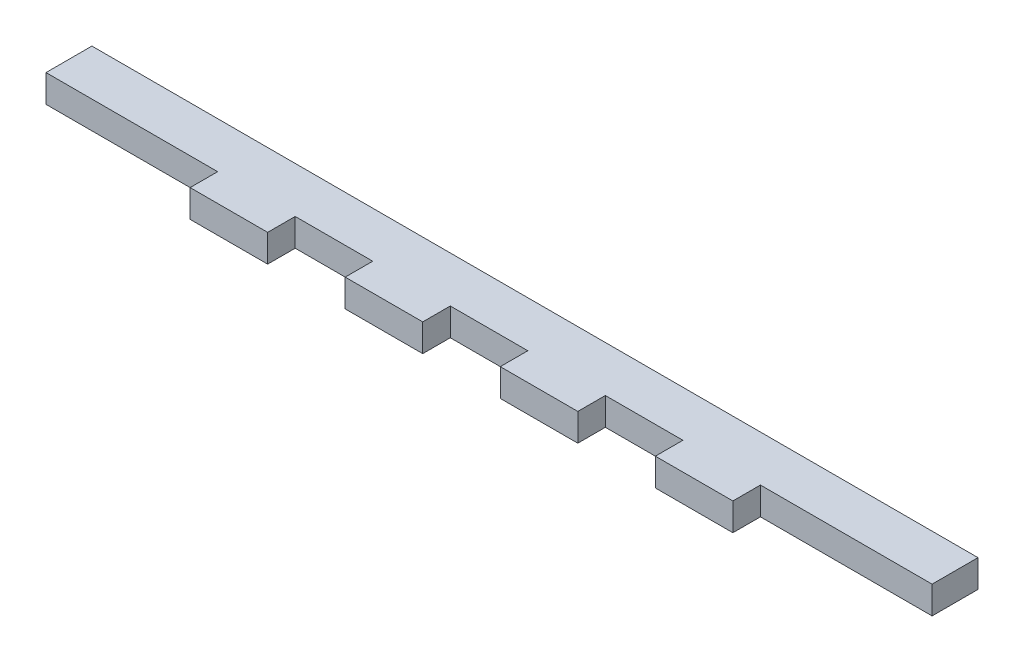
ISO-10303-21;
HEADER;
FILE_DESCRIPTION(('STEP AP214'),'2;1');
FILE_NAME('part.step','',(''),(''),'','','');
FILE_SCHEMA(('AUTOMOTIVE_DESIGN { 1 0 10303 214 1 1 1 1 }'));
ENDSEC;
DATA;
#1=APPLICATION_CONTEXT('core data for automotive mechanical design processes');
#2=APPLICATION_PROTOCOL_DEFINITION('international standard','automotive_design',2000,#1);
#3=PRODUCT_CONTEXT('',#1,'mechanical');
#4=PRODUCT('Part','Part','',(#3));
#5=PRODUCT_RELATED_PRODUCT_CATEGORY('part','',(#4));
#6=PRODUCT_DEFINITION_FORMATION('','',#4);
#7=PRODUCT_DEFINITION_CONTEXT('part definition',#1,'design');
#8=PRODUCT_DEFINITION('design','',#6,#7);
#9=PRODUCT_DEFINITION_SHAPE('','',#8);
#10=(LENGTH_UNIT() NAMED_UNIT(*) SI_UNIT(.MILLI.,.METRE.));
#11=(NAMED_UNIT(*) PLANE_ANGLE_UNIT() SI_UNIT($,.RADIAN.));
#12=(NAMED_UNIT(*) SI_UNIT($,.STERADIAN.) SOLID_ANGLE_UNIT());
#13=UNCERTAINTY_MEASURE_WITH_UNIT(LENGTH_MEASURE(1.E-05),#10,'distance_accuracy_value','');
#14=(GEOMETRIC_REPRESENTATION_CONTEXT(3) GLOBAL_UNCERTAINTY_ASSIGNED_CONTEXT((#13)) GLOBAL_UNIT_ASSIGNED_CONTEXT((#10,
#11,#12)) REPRESENTATION_CONTEXT('',''));
#15=CARTESIAN_POINT('',(0.,0.,0.));
#16=DIRECTION('',(0.,0.,1.));
#17=DIRECTION('',(1.,0.,0.));
#18=AXIS2_PLACEMENT_3D('',#15,#16,#17);
#19=CARTESIAN_POINT('',(-96.5,6.00000000000001,5.));
#20=DIRECTION('',(0.,0.,-1.));
#21=DIRECTION('',(-1.,0.,0.));
#22=AXIS2_PLACEMENT_3D('',#19,#20,#21);
#23=PLANE('',#22);
#24=DIRECTION('',(0.,-1.,0.));
#25=VECTOR('',#24,1.);
#26=CARTESIAN_POINT('',(42.2222222222222,23.9230178234926,5.));
#27=LINE('',#26,#25);
#28=CARTESIAN_POINT('',(42.2222222222222,6.00000000000001,5.));
#29=VERTEX_POINT('',#28);
#30=CARTESIAN_POINT('',(42.2222222222222,0.,5.));
#31=VERTEX_POINT('',#30);
#32=EDGE_CURVE('E64',#29,#31,#27,.T.);
#33=ORIENTED_EDGE('',*,*,#32,.F.);
#34=DIRECTION('',(1.,0.,0.));
#35=VECTOR('',#34,1.);
#36=CARTESIAN_POINT('',(-96.5,6.00000000000001,5.));
#37=LINE('',#36,#35);
#38=CARTESIAN_POINT('',(25.3333333333333,6.00000000000001,5.));
#39=VERTEX_POINT('',#38);
#40=EDGE_CURVE('E355',#39,#29,#37,.T.);
#41=ORIENTED_EDGE('',*,*,#40,.F.);
#42=DIRECTION('',(0.,-1.,0.));
#43=VECTOR('',#42,1.);
#44=CARTESIAN_POINT('',(25.3333333333333,23.9230178234926,5.));
#45=LINE('',#44,#43);
#46=CARTESIAN_POINT('',(25.3333333333333,0.,5.));
#47=VERTEX_POINT('',#46);
#48=EDGE_CURVE('E231',#39,#47,#45,.T.);
#49=ORIENTED_EDGE('',*,*,#48,.T.);
#50=DIRECTION('',(1.,0.,0.));
#51=VECTOR('',#50,1.);
#52=CARTESIAN_POINT('',(-96.5,0.,5.));
#53=LINE('',#52,#51);
#54=EDGE_CURVE('E361',#47,#31,#53,.T.);
#55=ORIENTED_EDGE('',*,*,#54,.T.);
#56=EDGE_LOOP('',(#33,#41,#49,#55));
#57=FACE_BOUND('',#56,.T.);
#58=ADVANCED_FACE('F39',(#57),#23,.F.);
#59=DIRECTION('',(0.,-1.,0.));
#60=VECTOR('',#59,1.);
#61=CARTESIAN_POINT('',(59.1111111111111,23.9230178234926,5.));
#62=LINE('',#61,#60);
#63=CARTESIAN_POINT('',(59.1111111111111,6.00000000000001,5.));
#64=VERTEX_POINT('',#63);
#65=CARTESIAN_POINT('',(59.1111111111111,0.,5.));
#66=VERTEX_POINT('',#65);
#67=EDGE_CURVE('E207',#64,#66,#62,.T.);
#68=ORIENTED_EDGE('',*,*,#67,.T.);
#69=CARTESIAN_POINT('',(96.5,0.,5.));
#70=VERTEX_POINT('',#69);
#71=EDGE_CURVE('E309',#66,#70,#53,.T.);
#72=ORIENTED_EDGE('',*,*,#71,.T.);
#73=DIRECTION('',(0.,-1.,0.));
#74=VECTOR('',#73,1.);
#75=CARTESIAN_POINT('',(96.5,6.00000000000001,5.));
#76=LINE('',#75,#74);
#77=CARTESIAN_POINT('',(96.5,6.00000000000001,5.));
#78=VERTEX_POINT('',#77);
#79=EDGE_CURVE('E316',#78,#70,#76,.T.);
#80=ORIENTED_EDGE('',*,*,#79,.F.);
#81=EDGE_CURVE('E56',#64,#78,#37,.T.);
#82=ORIENTED_EDGE('',*,*,#81,.F.);
#83=EDGE_LOOP('',(#68,#72,#80,#82));
#84=FACE_BOUND('',#83,.T.);
#85=ADVANCED_FACE('F360',(#84),#23,.F.);
#86=CARTESIAN_POINT('',(-42.2222222222222,6.00000000000001,5.));
#87=VERTEX_POINT('',#86);
#88=CARTESIAN_POINT('',(-25.3333333333333,6.00000000000001,5.));
#89=VERTEX_POINT('',#88);
#90=EDGE_CURVE('E302',#87,#89,#37,.T.);
#91=ORIENTED_EDGE('',*,*,#90,.F.);
#92=DIRECTION('',(0.,-1.,0.));
#93=VECTOR('',#92,1.);
#94=CARTESIAN_POINT('',(-42.2222222222222,23.9230178234926,5.));
#95=LINE('',#94,#93);
#96=CARTESIAN_POINT('',(-42.2222222222222,0.,5.));
#97=VERTEX_POINT('',#96);
#98=EDGE_CURVE('E257',#87,#97,#95,.T.);
#99=ORIENTED_EDGE('',*,*,#98,.T.);
#100=CARTESIAN_POINT('',(-25.3333333333333,0.,5.));
#101=VERTEX_POINT('',#100);
#102=EDGE_CURVE('E312',#97,#101,#53,.T.);
#103=ORIENTED_EDGE('',*,*,#102,.T.);
#104=DIRECTION('',(0.,-1.,0.));
#105=VECTOR('',#104,1.);
#106=CARTESIAN_POINT('',(-25.3333333333333,23.9230178234926,5.));
#107=LINE('',#106,#105);
#108=EDGE_CURVE('E285',#89,#101,#107,.T.);
#109=ORIENTED_EDGE('',*,*,#108,.F.);
#110=EDGE_LOOP('',(#91,#99,#103,#109));
#111=FACE_BOUND('',#110,.T.);
#112=ADVANCED_FACE('F352',(#111),#23,.F.);
#113=CARTESIAN_POINT('',(-96.5,0.,5.));
#114=VERTEX_POINT('',#113);
#115=CARTESIAN_POINT('',(-59.1111111111111,0.,5.));
#116=VERTEX_POINT('',#115);
#117=EDGE_CURVE('E310',#114,#116,#53,.T.);
#118=ORIENTED_EDGE('',*,*,#117,.T.);
#119=DIRECTION('',(0.,-1.,0.));
#120=VECTOR('',#119,1.);
#121=CARTESIAN_POINT('',(-59.1111111111111,23.9230178234926,5.));
#122=LINE('',#121,#120);
#123=CARTESIAN_POINT('',(-59.1111111111111,6.00000000000001,5.));
#124=VERTEX_POINT('',#123);
#125=EDGE_CURVE('E260',#124,#116,#122,.T.);
#126=ORIENTED_EDGE('',*,*,#125,.F.);
#127=CARTESIAN_POINT('',(-96.5,6.00000000000001,5.));
#128=VERTEX_POINT('',#127);
#129=EDGE_CURVE('E298',#128,#124,#37,.T.);
#130=ORIENTED_EDGE('',*,*,#129,.F.);
#131=DIRECTION('',(0.,-1.,0.));
#132=VECTOR('',#131,1.);
#133=CARTESIAN_POINT('',(-96.5,6.00000000000001,5.));
#134=LINE('',#133,#132);
#135=EDGE_CURVE('E48',#128,#114,#134,.T.);
#136=ORIENTED_EDGE('',*,*,#135,.T.);
#137=EDGE_LOOP('',(#118,#126,#130,#136));
#138=FACE_BOUND('',#137,.T.);
#139=ADVANCED_FACE('F333',(#138),#23,.F.);
#140=CARTESIAN_POINT('',(-96.5,6.00000000000001,-5.));
#141=DIRECTION('',(0.,0.,-1.));
#142=DIRECTION('',(-1.,0.,0.));
#143=AXIS2_PLACEMENT_3D('',#140,#141,#142);
#144=PLANE('',#143);
#145=DIRECTION('',(1.,0.,0.));
#146=VECTOR('',#145,1.);
#147=CARTESIAN_POINT('',(-96.5,0.,-5.));
#148=LINE('',#147,#146);
#149=CARTESIAN_POINT('',(-96.5,0.,-5.));
#150=VERTEX_POINT('',#149);
#151=CARTESIAN_POINT('',(96.5,0.,-5.));
#152=VERTEX_POINT('',#151);
#153=EDGE_CURVE('E290',#150,#152,#148,.T.);
#154=ORIENTED_EDGE('',*,*,#153,.F.);
#155=DIRECTION('',(0.,-1.,0.));
#156=VECTOR('',#155,1.);
#157=CARTESIAN_POINT('',(-96.5,6.00000000000001,-5.));
#158=LINE('',#157,#156);
#159=CARTESIAN_POINT('',(-96.5,6.00000000000001,-5.));
#160=VERTEX_POINT('',#159);
#161=EDGE_CURVE('E11',#160,#150,#158,.T.);
#162=ORIENTED_EDGE('',*,*,#161,.F.);
#163=DIRECTION('',(1.,0.,0.));
#164=VECTOR('',#163,1.);
#165=CARTESIAN_POINT('',(-96.5,6.00000000000001,-5.));
#166=LINE('',#165,#164);
#167=CARTESIAN_POINT('',(96.5,6.00000000000001,-5.));
#168=VERTEX_POINT('',#167);
#169=EDGE_CURVE('E291',#160,#168,#166,.T.);
#170=ORIENTED_EDGE('',*,*,#169,.T.);
#171=DIRECTION('',(0.,-1.,0.));
#172=VECTOR('',#171,1.);
#173=CARTESIAN_POINT('',(96.5,6.00000000000001,-5.));
#174=LINE('',#173,#172);
#175=EDGE_CURVE('E43',#168,#152,#174,.T.);
#176=ORIENTED_EDGE('',*,*,#175,.T.);
#177=EDGE_LOOP('',(#154,#162,#170,#176));
#178=FACE_BOUND('',#177,.T.);
#179=ADVANCED_FACE('F41',(#178),#144,.T.);
#180=CARTESIAN_POINT('',(-96.5,6.00000000000001,-5.));
#181=DIRECTION('',(1.,0.,0.));
#182=DIRECTION('',(0.,0.,-1.));
#183=AXIS2_PLACEMENT_3D('',#180,#181,#182);
#184=PLANE('',#183);
#185=DIRECTION('',(0.,0.,1.));
#186=VECTOR('',#185,1.);
#187=CARTESIAN_POINT('',(-96.5,0.,-5.));
#188=LINE('',#187,#186);
#189=EDGE_CURVE('E295',#150,#114,#188,.T.);
#190=ORIENTED_EDGE('',*,*,#189,.T.);
#191=ORIENTED_EDGE('',*,*,#135,.F.);
#192=DIRECTION('',(0.,0.,1.));
#193=VECTOR('',#192,1.);
#194=CARTESIAN_POINT('',(-96.5,6.00000000000001,-5.));
#195=LINE('',#194,#193);
#196=EDGE_CURVE('E301',#160,#128,#195,.T.);
#197=ORIENTED_EDGE('',*,*,#196,.F.);
#198=ORIENTED_EDGE('',*,*,#161,.T.);
#199=EDGE_LOOP('',(#190,#191,#197,#198));
#200=FACE_BOUND('',#199,.T.);
#201=ADVANCED_FACE('F329',(#200),#184,.F.);
#202=CARTESIAN_POINT('',(-8.44444444444445,0.,5.));
#203=VERTEX_POINT('',#202);
#204=CARTESIAN_POINT('',(8.44444444444445,0.,5.));
#205=VERTEX_POINT('',#204);
#206=EDGE_CURVE('E313',#203,#205,#53,.T.);
#207=ORIENTED_EDGE('',*,*,#206,.T.);
#208=DIRECTION('',(0.,-1.,0.));
#209=VECTOR('',#208,1.);
#210=CARTESIAN_POINT('',(8.44444444444445,23.9230178234926,5.));
#211=LINE('',#210,#209);
#212=CARTESIAN_POINT('',(8.44444444444445,6.00000000000001,5.));
#213=VERTEX_POINT('',#212);
#214=EDGE_CURVE('E234',#213,#205,#211,.T.);
#215=ORIENTED_EDGE('',*,*,#214,.F.);
#216=CARTESIAN_POINT('',(-8.44444444444445,6.00000000000001,5.));
#217=VERTEX_POINT('',#216);
#218=EDGE_CURVE('E303',#217,#213,#37,.T.);
#219=ORIENTED_EDGE('',*,*,#218,.F.);
#220=DIRECTION('',(0.,-1.,0.));
#221=VECTOR('',#220,1.);
#222=CARTESIAN_POINT('',(-8.44444444444445,23.9230178234926,5.));
#223=LINE('',#222,#221);
#224=EDGE_CURVE('E282',#217,#203,#223,.T.);
#225=ORIENTED_EDGE('',*,*,#224,.T.);
#226=EDGE_LOOP('',(#207,#215,#219,#225));
#227=FACE_BOUND('',#226,.T.);
#228=ADVANCED_FACE('F364',(#227),#23,.F.);
#229=CARTESIAN_POINT('',(96.5,6.00000000000001,-5.));
#230=DIRECTION('',(1.,0.,0.));
#231=DIRECTION('',(0.,0.,-1.));
#232=AXIS2_PLACEMENT_3D('',#229,#230,#231);
#233=PLANE('',#232);
#234=DIRECTION('',(0.,0.,1.));
#235=VECTOR('',#234,1.);
#236=CARTESIAN_POINT('',(96.5,0.,-5.));
#237=LINE('',#236,#235);
#238=EDGE_CURVE('E306',#152,#70,#237,.T.);
#239=ORIENTED_EDGE('',*,*,#238,.F.);
#240=ORIENTED_EDGE('',*,*,#175,.F.);
#241=DIRECTION('',(0.,0.,1.));
#242=VECTOR('',#241,1.);
#243=CARTESIAN_POINT('',(96.5,6.00000000000001,-5.));
#244=LINE('',#243,#242);
#245=EDGE_CURVE('E294',#168,#78,#244,.T.);
#246=ORIENTED_EDGE('',*,*,#245,.T.);
#247=ORIENTED_EDGE('',*,*,#79,.T.);
#248=EDGE_LOOP('',(#239,#240,#246,#247));
#249=FACE_BOUND('',#248,.T.);
#250=ADVANCED_FACE('F324',(#249),#233,.T.);
#251=CARTESIAN_POINT('',(0.,6.00000000000001,0.));
#252=DIRECTION('',(0.,-1.,0.));
#253=DIRECTION('',(0.,0.,-1.));
#254=AXIS2_PLACEMENT_3D('',#251,#252,#253);
#255=PLANE('',#254);
#256=ORIENTED_EDGE('',*,*,#169,.F.);
#257=ORIENTED_EDGE('',*,*,#196,.T.);
#258=ORIENTED_EDGE('',*,*,#129,.T.);
#259=DIRECTION('',(0.,0.,1.));
#260=VECTOR('',#259,1.);
#261=CARTESIAN_POINT('',(-59.1111111111111,6.00000000000001,0.));
#262=LINE('',#261,#260);
#263=CARTESIAN_POINT('',(-59.1111111111111,6.00000000000001,11.));
#264=VERTEX_POINT('',#263);
#265=EDGE_CURVE('E246',#124,#264,#262,.T.);
#266=ORIENTED_EDGE('',*,*,#265,.T.);
#267=DIRECTION('',(1.,0.,0.));
#268=VECTOR('',#267,1.);
#269=CARTESIAN_POINT('',(0.,6.00000000000001,11.));
#270=LINE('',#269,#268);
#271=CARTESIAN_POINT('',(-42.2222222222222,6.00000000000001,11.));
#272=VERTEX_POINT('',#271);
#273=EDGE_CURVE('E243',#264,#272,#270,.T.);
#274=ORIENTED_EDGE('',*,*,#273,.T.);
#275=DIRECTION('',(0.,0.,-1.));
#276=VECTOR('',#275,1.);
#277=CARTESIAN_POINT('',(-42.2222222222222,6.00000000000001,0.));
#278=LINE('',#277,#276);
#279=EDGE_CURVE('E240',#272,#87,#278,.T.);
#280=ORIENTED_EDGE('',*,*,#279,.T.);
#281=ORIENTED_EDGE('',*,*,#90,.T.);
#282=DIRECTION('',(0.,0.,1.));
#283=VECTOR('',#282,1.);
#284=CARTESIAN_POINT('',(-25.3333333333333,6.00000000000001,0.));
#285=LINE('',#284,#283);
#286=CARTESIAN_POINT('',(-25.3333333333333,6.00000000000001,11.));
#287=VERTEX_POINT('',#286);
#288=EDGE_CURVE('E272',#89,#287,#285,.T.);
#289=ORIENTED_EDGE('',*,*,#288,.T.);
#290=DIRECTION('',(1.,0.,0.));
#291=VECTOR('',#290,1.);
#292=CARTESIAN_POINT('',(0.,6.00000000000001,11.));
#293=LINE('',#292,#291);
#294=CARTESIAN_POINT('',(-8.44444444444445,6.00000000000001,11.));
#295=VERTEX_POINT('',#294);
#296=EDGE_CURVE('E269',#287,#295,#293,.T.);
#297=ORIENTED_EDGE('',*,*,#296,.T.);
#298=DIRECTION('',(0.,0.,1.));
#299=VECTOR('',#298,1.);
#300=CARTESIAN_POINT('',(-8.44444444444445,6.00000000000001,0.));
#301=LINE('',#300,#299);
#302=EDGE_CURVE('E266',#217,#295,#301,.T.);
#303=ORIENTED_EDGE('',*,*,#302,.F.);
#304=ORIENTED_EDGE('',*,*,#218,.T.);
#305=DIRECTION('',(0.,0.,1.));
#306=VECTOR('',#305,1.);
#307=CARTESIAN_POINT('',(8.44444444444445,6.00000000000001,0.));
#308=LINE('',#307,#306);
#309=CARTESIAN_POINT('',(8.44444444444445,6.00000000000001,11.));
#310=VERTEX_POINT('',#309);
#311=EDGE_CURVE('E219',#213,#310,#308,.T.);
#312=ORIENTED_EDGE('',*,*,#311,.T.);
#313=DIRECTION('',(-1.,0.,0.));
#314=VECTOR('',#313,1.);
#315=CARTESIAN_POINT('',(0.,6.00000000000001,11.));
#316=LINE('',#315,#314);
#317=CARTESIAN_POINT('',(25.3333333333333,6.00000000000001,11.));
#318=VERTEX_POINT('',#317);
#319=EDGE_CURVE('E215',#318,#310,#316,.T.);
#320=ORIENTED_EDGE('',*,*,#319,.F.);
#321=DIRECTION('',(0.,0.,1.));
#322=VECTOR('',#321,1.);
#323=CARTESIAN_POINT('',(25.3333333333333,6.00000000000001,0.));
#324=LINE('',#323,#322);
#325=EDGE_CURVE('E212',#39,#318,#324,.T.);
#326=ORIENTED_EDGE('',*,*,#325,.F.);
#327=ORIENTED_EDGE('',*,*,#40,.T.);
#328=DIRECTION('',(0.,0.,-1.));
#329=VECTOR('',#328,1.);
#330=CARTESIAN_POINT('',(42.2222222222222,6.00000000000001,0.));
#331=LINE('',#330,#329);
#332=CARTESIAN_POINT('',(42.2222222222222,6.00000000000001,11.));
#333=VERTEX_POINT('',#332);
#334=EDGE_CURVE('E206',#333,#29,#331,.T.);
#335=ORIENTED_EDGE('',*,*,#334,.F.);
#336=DIRECTION('',(-1.,0.,0.));
#337=VECTOR('',#336,1.);
#338=CARTESIAN_POINT('',(0.,6.00000000000001,11.));
#339=LINE('',#338,#337);
#340=CARTESIAN_POINT('',(59.1111111111111,6.00000000000001,11.));
#341=VERTEX_POINT('',#340);
#342=EDGE_CURVE('E185',#341,#333,#339,.T.);
#343=ORIENTED_EDGE('',*,*,#342,.F.);
#344=DIRECTION('',(0.,0.,1.));
#345=VECTOR('',#344,1.);
#346=CARTESIAN_POINT('',(59.1111111111111,6.00000000000001,0.));
#347=LINE('',#346,#345);
#348=EDGE_CURVE('E211',#64,#341,#347,.T.);
#349=ORIENTED_EDGE('',*,*,#348,.F.);
#350=ORIENTED_EDGE('',*,*,#81,.T.);
#351=ORIENTED_EDGE('',*,*,#245,.F.);
#352=EDGE_LOOP('',(#256,#257,#258,#266,#274,#280,#281,#289,#297,#303,#304,#312,#320,#326,#327,
#335,#343,#349,#350,#351));
#353=FACE_BOUND('',#352,.T.);
#354=ADVANCED_FACE('F336',(#353),#255,.F.);
#355=CARTESIAN_POINT('',(0.,0.,0.));
#356=DIRECTION('',(0.,-1.,0.));
#357=DIRECTION('',(0.,0.,-1.));
#358=AXIS2_PLACEMENT_3D('',#355,#356,#357);
#359=PLANE('',#358);
#360=ORIENTED_EDGE('',*,*,#153,.T.);
#361=ORIENTED_EDGE('',*,*,#238,.T.);
#362=ORIENTED_EDGE('',*,*,#71,.F.);
#363=DIRECTION('',(0.,0.,-1.));
#364=VECTOR('',#363,1.);
#365=CARTESIAN_POINT('',(59.1111111111111,0.,0.));
#366=LINE('',#365,#364);
#367=CARTESIAN_POINT('',(59.1111111111111,0.,11.));
#368=VERTEX_POINT('',#367);
#369=EDGE_CURVE('E188',#368,#66,#366,.T.);
#370=ORIENTED_EDGE('',*,*,#369,.F.);
#371=DIRECTION('',(1.,0.,0.));
#372=VECTOR('',#371,1.);
#373=CARTESIAN_POINT('',(0.,0.,11.));
#374=LINE('',#373,#372);
#375=CARTESIAN_POINT('',(42.2222222222222,0.,11.));
#376=VERTEX_POINT('',#375);
#377=EDGE_CURVE('E184',#376,#368,#374,.T.);
#378=ORIENTED_EDGE('',*,*,#377,.F.);
#379=DIRECTION('',(0.,0.,1.));
#380=VECTOR('',#379,1.);
#381=CARTESIAN_POINT('',(42.2222222222222,0.,0.));
#382=LINE('',#381,#380);
#383=EDGE_CURVE('E191',#31,#376,#382,.T.);
#384=ORIENTED_EDGE('',*,*,#383,.F.);
#385=ORIENTED_EDGE('',*,*,#54,.F.);
#386=DIRECTION('',(0.,0.,-1.));
#387=VECTOR('',#386,1.);
#388=CARTESIAN_POINT('',(25.3333333333333,0.,0.));
#389=LINE('',#388,#387);
#390=CARTESIAN_POINT('',(25.3333333333333,0.,11.));
#391=VERTEX_POINT('',#390);
#392=EDGE_CURVE('E226',#391,#47,#389,.T.);
#393=ORIENTED_EDGE('',*,*,#392,.F.);
#394=DIRECTION('',(1.,0.,0.));
#395=VECTOR('',#394,1.);
#396=CARTESIAN_POINT('',(0.,0.,11.));
#397=LINE('',#396,#395);
#398=CARTESIAN_POINT('',(8.44444444444445,0.,11.));
#399=VERTEX_POINT('',#398);
#400=EDGE_CURVE('E220',#399,#391,#397,.T.);
#401=ORIENTED_EDGE('',*,*,#400,.F.);
#402=DIRECTION('',(0.,0.,-1.));
#403=VECTOR('',#402,1.);
#404=CARTESIAN_POINT('',(8.44444444444445,0.,0.));
#405=LINE('',#404,#403);
#406=EDGE_CURVE('E223',#399,#205,#405,.T.);
#407=ORIENTED_EDGE('',*,*,#406,.T.);
#408=ORIENTED_EDGE('',*,*,#206,.F.);
#409=DIRECTION('',(0.,0.,-1.));
#410=VECTOR('',#409,1.);
#411=CARTESIAN_POINT('',(-8.44444444444445,0.,0.));
#412=LINE('',#411,#410);
#413=CARTESIAN_POINT('',(-8.44444444444445,0.,11.));
#414=VERTEX_POINT('',#413);
#415=EDGE_CURVE('E278',#414,#203,#412,.T.);
#416=ORIENTED_EDGE('',*,*,#415,.F.);
#417=DIRECTION('',(-1.,0.,0.));
#418=VECTOR('',#417,1.);
#419=CARTESIAN_POINT('',(0.,0.,11.));
#420=LINE('',#419,#418);
#421=CARTESIAN_POINT('',(-25.3333333333333,0.,11.));
#422=VERTEX_POINT('',#421);
#423=EDGE_CURVE('E265',#414,#422,#420,.T.);
#424=ORIENTED_EDGE('',*,*,#423,.T.);
#425=DIRECTION('',(0.,0.,-1.));
#426=VECTOR('',#425,1.);
#427=CARTESIAN_POINT('',(-25.3333333333333,0.,0.));
#428=LINE('',#427,#426);
#429=EDGE_CURVE('E275',#422,#101,#428,.T.);
#430=ORIENTED_EDGE('',*,*,#429,.T.);
#431=ORIENTED_EDGE('',*,*,#102,.F.);
#432=DIRECTION('',(0.,0.,1.));
#433=VECTOR('',#432,1.);
#434=CARTESIAN_POINT('',(-42.2222222222222,0.,0.));
#435=LINE('',#434,#433);
#436=CARTESIAN_POINT('',(-42.2222222222222,0.,11.));
#437=VERTEX_POINT('',#436);
#438=EDGE_CURVE('E252',#97,#437,#435,.T.);
#439=ORIENTED_EDGE('',*,*,#438,.T.);
#440=DIRECTION('',(-1.,0.,0.));
#441=VECTOR('',#440,1.);
#442=CARTESIAN_POINT('',(0.,0.,11.));
#443=LINE('',#442,#441);
#444=CARTESIAN_POINT('',(-59.1111111111111,0.,11.));
#445=VERTEX_POINT('',#444);
#446=EDGE_CURVE('E239',#437,#445,#443,.T.);
#447=ORIENTED_EDGE('',*,*,#446,.T.);
#448=DIRECTION('',(0.,0.,-1.));
#449=VECTOR('',#448,1.);
#450=CARTESIAN_POINT('',(-59.1111111111111,0.,0.));
#451=LINE('',#450,#449);
#452=EDGE_CURVE('E249',#445,#116,#451,.T.);
#453=ORIENTED_EDGE('',*,*,#452,.T.);
#454=ORIENTED_EDGE('',*,*,#117,.F.);
#455=ORIENTED_EDGE('',*,*,#189,.F.);
#456=EDGE_LOOP('',(#360,#361,#362,#370,#378,#384,#385,#393,#401,#407,#408,#416,#424,#430,#431,
#439,#447,#453,#454,#455));
#457=FACE_BOUND('',#456,.T.);
#458=ADVANCED_FACE('F197',(#457),#359,.T.);
#459=CARTESIAN_POINT('',(0.,23.9230178234926,11.));
#460=DIRECTION('',(0.,0.,1.));
#461=DIRECTION('',(1.,0.,0.));
#462=AXIS2_PLACEMENT_3D('',#459,#460,#461);
#463=PLANE('',#462);
#464=ORIENTED_EDGE('',*,*,#296,.F.);
#465=DIRECTION('',(0.,-1.,0.));
#466=VECTOR('',#465,1.);
#467=CARTESIAN_POINT('',(-25.3333333333333,23.9230178234926,11.));
#468=LINE('',#467,#466);
#469=EDGE_CURVE('E280',#287,#422,#468,.T.);
#470=ORIENTED_EDGE('',*,*,#469,.T.);
#471=ORIENTED_EDGE('',*,*,#423,.F.);
#472=DIRECTION('',(0.,-1.,0.));
#473=VECTOR('',#472,1.);
#474=CARTESIAN_POINT('',(-8.44444444444445,23.9230178234926,11.));
#475=LINE('',#474,#473);
#476=EDGE_CURVE('E270',#295,#414,#475,.T.);
#477=ORIENTED_EDGE('',*,*,#476,.F.);
#478=EDGE_LOOP('',(#464,#470,#471,#477));
#479=FACE_BOUND('',#478,.T.);
#480=ADVANCED_FACE('F434',(#479),#463,.T.);
#481=CARTESIAN_POINT('',(-8.44444444444445,23.9230178234926,0.));
#482=DIRECTION('',(-1.,0.,0.));
#483=DIRECTION('',(0.,0.,1.));
#484=AXIS2_PLACEMENT_3D('',#481,#482,#483);
#485=PLANE('',#484);
#486=ORIENTED_EDGE('',*,*,#224,.F.);
#487=ORIENTED_EDGE('',*,*,#302,.T.);
#488=ORIENTED_EDGE('',*,*,#476,.T.);
#489=ORIENTED_EDGE('',*,*,#415,.T.);
#490=EDGE_LOOP('',(#486,#487,#488,#489));
#491=FACE_BOUND('',#490,.T.);
#492=ADVANCED_FACE('F547',(#491),#485,.F.);
#493=CARTESIAN_POINT('',(-25.3333333333333,23.9230178234926,0.));
#494=DIRECTION('',(-1.,0.,0.));
#495=DIRECTION('',(0.,0.,1.));
#496=AXIS2_PLACEMENT_3D('',#493,#494,#495);
#497=PLANE('',#496);
#498=ORIENTED_EDGE('',*,*,#288,.F.);
#499=ORIENTED_EDGE('',*,*,#108,.T.);
#500=ORIENTED_EDGE('',*,*,#429,.F.);
#501=ORIENTED_EDGE('',*,*,#469,.F.);
#502=EDGE_LOOP('',(#498,#499,#500,#501));
#503=FACE_BOUND('',#502,.T.);
#504=ADVANCED_FACE('F537',(#503),#497,.T.);
#505=CARTESIAN_POINT('',(0.,23.9230178234926,11.));
#506=DIRECTION('',(0.,0.,1.));
#507=DIRECTION('',(1.,0.,0.));
#508=AXIS2_PLACEMENT_3D('',#505,#506,#507);
#509=PLANE('',#508);
#510=ORIENTED_EDGE('',*,*,#273,.F.);
#511=DIRECTION('',(0.,-1.,0.));
#512=VECTOR('',#511,1.);
#513=CARTESIAN_POINT('',(-59.1111111111111,23.9230178234926,11.));
#514=LINE('',#513,#512);
#515=EDGE_CURVE('E255',#264,#445,#514,.T.);
#516=ORIENTED_EDGE('',*,*,#515,.T.);
#517=ORIENTED_EDGE('',*,*,#446,.F.);
#518=DIRECTION('',(0.,-1.,0.));
#519=VECTOR('',#518,1.);
#520=CARTESIAN_POINT('',(-42.2222222222222,23.9230178234926,11.));
#521=LINE('',#520,#519);
#522=EDGE_CURVE('E244',#272,#437,#521,.T.);
#523=ORIENTED_EDGE('',*,*,#522,.F.);
#524=EDGE_LOOP('',(#510,#516,#517,#523));
#525=FACE_BOUND('',#524,.T.);
#526=ADVANCED_FACE('F344',(#525),#509,.T.);
#527=CARTESIAN_POINT('',(-42.2222222222222,23.9230178234926,0.));
#528=DIRECTION('',(1.,0.,0.));
#529=DIRECTION('',(0.,0.,-1.));
#530=AXIS2_PLACEMENT_3D('',#527,#528,#529);
#531=PLANE('',#530);
#532=ORIENTED_EDGE('',*,*,#279,.F.);
#533=ORIENTED_EDGE('',*,*,#522,.T.);
#534=ORIENTED_EDGE('',*,*,#438,.F.);
#535=ORIENTED_EDGE('',*,*,#98,.F.);
#536=EDGE_LOOP('',(#532,#533,#534,#535));
#537=FACE_BOUND('',#536,.T.);
#538=ADVANCED_FACE('F349',(#537),#531,.T.);
#539=CARTESIAN_POINT('',(-59.1111111111111,23.9230178234926,0.));
#540=DIRECTION('',(-1.,0.,0.));
#541=DIRECTION('',(0.,0.,1.));
#542=AXIS2_PLACEMENT_3D('',#539,#540,#541);
#543=PLANE('',#542);
#544=ORIENTED_EDGE('',*,*,#265,.F.);
#545=ORIENTED_EDGE('',*,*,#125,.T.);
#546=ORIENTED_EDGE('',*,*,#452,.F.);
#547=ORIENTED_EDGE('',*,*,#515,.F.);
#548=EDGE_LOOP('',(#544,#545,#546,#547));
#549=FACE_BOUND('',#548,.T.);
#550=ADVANCED_FACE('F340',(#549),#543,.T.);
#551=CARTESIAN_POINT('',(0.,23.9230178234926,11.));
#552=DIRECTION('',(0.,0.,-1.));
#553=DIRECTION('',(-1.,0.,0.));
#554=AXIS2_PLACEMENT_3D('',#551,#552,#553);
#555=PLANE('',#554);
#556=DIRECTION('',(0.,-1.,0.));
#557=VECTOR('',#556,1.);
#558=CARTESIAN_POINT('',(25.3333333333333,23.9230178234926,11.));
#559=LINE('',#558,#557);
#560=EDGE_CURVE('E216',#318,#391,#559,.T.);
#561=ORIENTED_EDGE('',*,*,#560,.F.);
#562=ORIENTED_EDGE('',*,*,#319,.T.);
#563=DIRECTION('',(0.,-1.,0.));
#564=VECTOR('',#563,1.);
#565=CARTESIAN_POINT('',(8.44444444444445,23.9230178234926,11.));
#566=LINE('',#565,#564);
#567=EDGE_CURVE('E229',#310,#399,#566,.T.);
#568=ORIENTED_EDGE('',*,*,#567,.T.);
#569=ORIENTED_EDGE('',*,*,#400,.T.);
#570=EDGE_LOOP('',(#561,#562,#568,#569));
#571=FACE_BOUND('',#570,.T.);
#572=ADVANCED_FACE('F377',(#571),#555,.F.);
#573=CARTESIAN_POINT('',(25.3333333333333,23.9230178234926,0.));
#574=DIRECTION('',(-1.,0.,0.));
#575=DIRECTION('',(0.,0.,1.));
#576=AXIS2_PLACEMENT_3D('',#573,#574,#575);
#577=PLANE('',#576);
#578=ORIENTED_EDGE('',*,*,#48,.F.);
#579=ORIENTED_EDGE('',*,*,#325,.T.);
#580=ORIENTED_EDGE('',*,*,#560,.T.);
#581=ORIENTED_EDGE('',*,*,#392,.T.);
#582=EDGE_LOOP('',(#578,#579,#580,#581));
#583=FACE_BOUND('',#582,.T.);
#584=ADVANCED_FACE('F380',(#583),#577,.F.);
#585=CARTESIAN_POINT('',(8.44444444444445,23.9230178234926,0.));
#586=DIRECTION('',(-1.,0.,0.));
#587=DIRECTION('',(0.,0.,1.));
#588=AXIS2_PLACEMENT_3D('',#585,#586,#587);
#589=PLANE('',#588);
#590=ORIENTED_EDGE('',*,*,#311,.F.);
#591=ORIENTED_EDGE('',*,*,#214,.T.);
#592=ORIENTED_EDGE('',*,*,#406,.F.);
#593=ORIENTED_EDGE('',*,*,#567,.F.);
#594=EDGE_LOOP('',(#590,#591,#592,#593));
#595=FACE_BOUND('',#594,.T.);
#596=ADVANCED_FACE('F371',(#595),#589,.T.);
#597=CARTESIAN_POINT('',(42.2222222222222,23.9230178234926,0.));
#598=DIRECTION('',(1.,0.,0.));
#599=DIRECTION('',(0.,0.,-1.));
#600=AXIS2_PLACEMENT_3D('',#597,#598,#599);
#601=PLANE('',#600);
#602=DIRECTION('',(0.,-1.,0.));
#603=VECTOR('',#602,1.);
#604=CARTESIAN_POINT('',(42.2222222222222,23.9230178234926,11.));
#605=LINE('',#604,#603);
#606=EDGE_CURVE('E179',#333,#376,#605,.T.);
#607=ORIENTED_EDGE('',*,*,#606,.F.);
#608=ORIENTED_EDGE('',*,*,#334,.T.);
#609=ORIENTED_EDGE('',*,*,#32,.T.);
#610=ORIENTED_EDGE('',*,*,#383,.T.);
#611=EDGE_LOOP('',(#607,#608,#609,#610));
#612=FACE_BOUND('',#611,.T.);
#613=ADVANCED_FACE('F192',(#612),#601,.F.);
#614=CARTESIAN_POINT('',(59.1111111111111,23.9230178234926,0.));
#615=DIRECTION('',(-1.,0.,0.));
#616=DIRECTION('',(0.,0.,1.));
#617=AXIS2_PLACEMENT_3D('',#614,#615,#616);
#618=PLANE('',#617);
#619=ORIENTED_EDGE('',*,*,#67,.F.);
#620=ORIENTED_EDGE('',*,*,#348,.T.);
#621=DIRECTION('',(0.,-1.,0.));
#622=VECTOR('',#621,1.);
#623=CARTESIAN_POINT('',(59.1111111111111,23.9230178234926,11.));
#624=LINE('',#623,#622);
#625=EDGE_CURVE('E204',#341,#368,#624,.T.);
#626=ORIENTED_EDGE('',*,*,#625,.T.);
#627=ORIENTED_EDGE('',*,*,#369,.T.);
#628=EDGE_LOOP('',(#619,#620,#626,#627));
#629=FACE_BOUND('',#628,.T.);
#630=ADVANCED_FACE('F474',(#629),#618,.F.);
#631=CARTESIAN_POINT('',(0.,23.9230178234926,11.));
#632=DIRECTION('',(0.,0.,-1.));
#633=DIRECTION('',(-1.,0.,0.));
#634=AXIS2_PLACEMENT_3D('',#631,#632,#633);
#635=PLANE('',#634);
#636=ORIENTED_EDGE('',*,*,#625,.F.);
#637=ORIENTED_EDGE('',*,*,#342,.T.);
#638=ORIENTED_EDGE('',*,*,#606,.T.);
#639=ORIENTED_EDGE('',*,*,#377,.T.);
#640=EDGE_LOOP('',(#636,#637,#638,#639));
#641=FACE_BOUND('',#640,.T.);
#642=ADVANCED_FACE('F182',(#641),#635,.F.);
#643=CLOSED_SHELL('',(#58,#85,#112,#139,#179,#201,#228,#250,#354,#458,#480,#492,#504,#526,#538,
#550,#572,#584,#596,#613,#630,#642));
#644=MANIFOLD_SOLID_BREP('B2',#643);
#645=ADVANCED_BREP_SHAPE_REPRESENTATION('',(#18,#644),#14);
#646=SHAPE_DEFINITION_REPRESENTATION(#9,#645);
ENDSEC;
END-ISO-10303-21;
